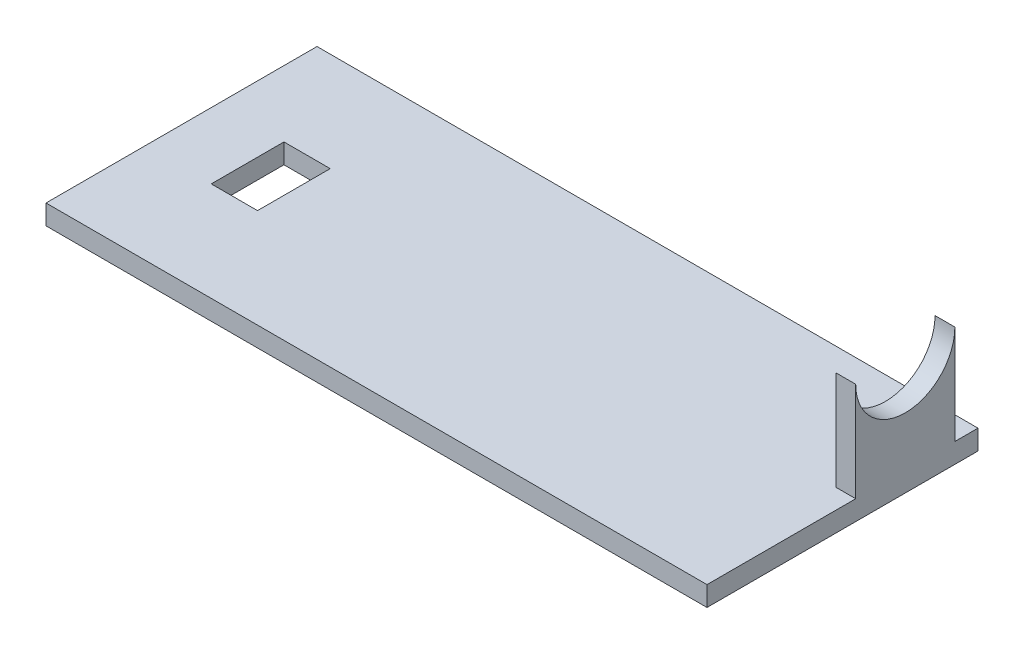
ISO-10303-21;
HEADER;
FILE_DESCRIPTION(('STEP AP214'),'2;1');
FILE_NAME('part.step','',(''),(''),'','','');
FILE_SCHEMA(('AUTOMOTIVE_DESIGN { 1 0 10303 214 1 1 1 1 }'));
ENDSEC;
DATA;
#1=APPLICATION_CONTEXT('core data for automotive mechanical design processes');
#2=APPLICATION_PROTOCOL_DEFINITION('international standard','automotive_design',2000,#1);
#3=PRODUCT_CONTEXT('',#1,'mechanical');
#4=PRODUCT('Part','Part','',(#3));
#5=PRODUCT_RELATED_PRODUCT_CATEGORY('part','',(#4));
#6=PRODUCT_DEFINITION_FORMATION('','',#4);
#7=PRODUCT_DEFINITION_CONTEXT('part definition',#1,'design');
#8=PRODUCT_DEFINITION('design','',#6,#7);
#9=PRODUCT_DEFINITION_SHAPE('','',#8);
#10=(LENGTH_UNIT() NAMED_UNIT(*) SI_UNIT(.MILLI.,.METRE.));
#11=(NAMED_UNIT(*) PLANE_ANGLE_UNIT() SI_UNIT($,.RADIAN.));
#12=(NAMED_UNIT(*) SI_UNIT($,.STERADIAN.) SOLID_ANGLE_UNIT());
#13=UNCERTAINTY_MEASURE_WITH_UNIT(LENGTH_MEASURE(1.E-05),#10,'distance_accuracy_value','');
#14=(GEOMETRIC_REPRESENTATION_CONTEXT(3) GLOBAL_UNCERTAINTY_ASSIGNED_CONTEXT((#13)) GLOBAL_UNIT_ASSIGNED_CONTEXT((#10,
#11,#12)) REPRESENTATION_CONTEXT('',''));
#15=CARTESIAN_POINT('',(0.,0.,0.));
#16=DIRECTION('',(0.,0.,1.));
#17=DIRECTION('',(1.,0.,0.));
#18=AXIS2_PLACEMENT_3D('',#15,#16,#17);
#19=CARTESIAN_POINT('',(-50.,3.,20.5));
#20=DIRECTION('',(1.,0.,0.));
#21=DIRECTION('',(0.,0.,-1.));
#22=AXIS2_PLACEMENT_3D('',#19,#20,#21);
#23=PLANE('',#22);
#24=DIRECTION('',(0.,0.,1.));
#25=VECTOR('',#24,1.);
#26=CARTESIAN_POINT('',(-50.,0.,20.5));
#27=LINE('',#26,#25);
#28=CARTESIAN_POINT('',(-50.,0.,-20.5));
#29=VERTEX_POINT('',#28);
#30=CARTESIAN_POINT('',(-50.,0.,20.5));
#31=VERTEX_POINT('',#30);
#32=EDGE_CURVE('E209',#29,#31,#27,.T.);
#33=ORIENTED_EDGE('',*,*,#32,.T.);
#34=DIRECTION('',(0.,-1.,0.));
#35=VECTOR('',#34,1.);
#36=CARTESIAN_POINT('',(-50.,3.,20.5));
#37=LINE('',#36,#35);
#38=CARTESIAN_POINT('',(-50.,3.,20.5));
#39=VERTEX_POINT('',#38);
#40=EDGE_CURVE('E11',#39,#31,#37,.T.);
#41=ORIENTED_EDGE('',*,*,#40,.F.);
#42=DIRECTION('',(0.,0.,1.));
#43=VECTOR('',#42,1.);
#44=CARTESIAN_POINT('',(-50.,3.,20.5));
#45=LINE('',#44,#43);
#46=CARTESIAN_POINT('',(-50.,3.,-20.5));
#47=VERTEX_POINT('',#46);
#48=EDGE_CURVE('E219',#47,#39,#45,.T.);
#49=ORIENTED_EDGE('',*,*,#48,.F.);
#50=DIRECTION('',(0.,-1.,0.));
#51=VECTOR('',#50,1.);
#52=CARTESIAN_POINT('',(-50.,3.,-20.5));
#53=LINE('',#52,#51);
#54=EDGE_CURVE('E233',#47,#29,#53,.T.);
#55=ORIENTED_EDGE('',*,*,#54,.T.);
#56=EDGE_LOOP('',(#33,#41,#49,#55));
#57=FACE_BOUND('',#56,.T.);
#58=ADVANCED_FACE('F39',(#57),#23,.F.);
#59=CARTESIAN_POINT('',(50.,3.,20.5));
#60=DIRECTION('',(0.,0.,-1.));
#61=DIRECTION('',(-1.,0.,0.));
#62=AXIS2_PLACEMENT_3D('',#59,#60,#61);
#63=PLANE('',#62);
#64=DIRECTION('',(1.,0.,0.));
#65=VECTOR('',#64,1.);
#66=CARTESIAN_POINT('',(50.,0.,20.5));
#67=LINE('',#66,#65);
#68=CARTESIAN_POINT('',(50.,0.,20.5));
#69=VERTEX_POINT('',#68);
#70=EDGE_CURVE('E237',#31,#69,#67,.T.);
#71=ORIENTED_EDGE('',*,*,#70,.T.);
#72=DIRECTION('',(0.,-1.,0.));
#73=VECTOR('',#72,1.);
#74=CARTESIAN_POINT('',(50.,3.,20.5));
#75=LINE('',#74,#73);
#76=CARTESIAN_POINT('',(50.,3.,20.5));
#77=VERTEX_POINT('',#76);
#78=EDGE_CURVE('E47',#77,#69,#75,.T.);
#79=ORIENTED_EDGE('',*,*,#78,.F.);
#80=DIRECTION('',(1.,0.,0.));
#81=VECTOR('',#80,1.);
#82=CARTESIAN_POINT('',(50.,3.,20.5));
#83=LINE('',#82,#81);
#84=EDGE_CURVE('E223',#39,#77,#83,.T.);
#85=ORIENTED_EDGE('',*,*,#84,.F.);
#86=ORIENTED_EDGE('',*,*,#40,.T.);
#87=EDGE_LOOP('',(#71,#79,#85,#86));
#88=FACE_BOUND('',#87,.T.);
#89=ADVANCED_FACE('F287',(#88),#63,.F.);
#90=CARTESIAN_POINT('',(50.,3.,20.5));
#91=DIRECTION('',(-1.,0.,0.));
#92=DIRECTION('',(0.,0.,1.));
#93=AXIS2_PLACEMENT_3D('',#90,#91,#92);
#94=PLANE('',#93);
#95=DIRECTION('',(0.,-1.,0.));
#96=VECTOR('',#95,1.);
#97=CARTESIAN_POINT('',(50.,18.,-17.));
#98=LINE('',#97,#96);
#99=CARTESIAN_POINT('',(50.,18.,-17.));
#100=VERTEX_POINT('',#99);
#101=CARTESIAN_POINT('',(50.,3.,-17.));
#102=VERTEX_POINT('',#101);
#103=EDGE_CURVE('E141',#100,#102,#98,.T.);
#104=ORIENTED_EDGE('',*,*,#103,.F.);
#105=CARTESIAN_POINT('',(50.,18.,-9.50000000000002));
#106=DIRECTION('',(1.,0.,0.));
#107=DIRECTION('',(0.,0.,-1.));
#108=AXIS2_PLACEMENT_3D('',#105,#106,#107);
#109=CIRCLE('',#108,7.5);
#110=CARTESIAN_POINT('',(50.,18.,-2.00000000000002));
#111=VERTEX_POINT('',#110);
#112=EDGE_CURVE('E125',#111,#100,#109,.T.);
#113=ORIENTED_EDGE('',*,*,#112,.F.);
#114=DIRECTION('',(0.,-1.,0.));
#115=VECTOR('',#114,1.);
#116=CARTESIAN_POINT('',(50.,18.,-2.00000000000002));
#117=LINE('',#116,#115);
#118=CARTESIAN_POINT('',(50.,3.,-2.00000000000002));
#119=VERTEX_POINT('',#118);
#120=EDGE_CURVE('E153',#111,#119,#117,.T.);
#121=ORIENTED_EDGE('',*,*,#120,.T.);
#122=DIRECTION('',(0.,0.,-1.));
#123=VECTOR('',#122,1.);
#124=CARTESIAN_POINT('',(50.,3.,20.5));
#125=LINE('',#124,#123);
#126=EDGE_CURVE('E227',#77,#119,#125,.T.);
#127=ORIENTED_EDGE('',*,*,#126,.F.);
#128=ORIENTED_EDGE('',*,*,#78,.T.);
#129=DIRECTION('',(0.,0.,-1.));
#130=VECTOR('',#129,1.);
#131=CARTESIAN_POINT('',(50.,0.,20.5));
#132=LINE('',#131,#130);
#133=CARTESIAN_POINT('',(50.,0.,-20.5));
#134=VERTEX_POINT('',#133);
#135=EDGE_CURVE('E240',#69,#134,#132,.T.);
#136=ORIENTED_EDGE('',*,*,#135,.T.);
#137=DIRECTION('',(0.,-1.,0.));
#138=VECTOR('',#137,1.);
#139=CARTESIAN_POINT('',(50.,3.,-20.5));
#140=LINE('',#139,#138);
#141=CARTESIAN_POINT('',(50.,3.,-20.5));
#142=VERTEX_POINT('',#141);
#143=EDGE_CURVE('E248',#142,#134,#140,.T.);
#144=ORIENTED_EDGE('',*,*,#143,.F.);
#145=EDGE_CURVE('E144',#102,#142,#125,.T.);
#146=ORIENTED_EDGE('',*,*,#145,.F.);
#147=EDGE_LOOP('',(#104,#113,#121,#127,#128,#136,#144,#146));
#148=FACE_BOUND('',#147,.T.);
#149=ADVANCED_FACE('F142',(#148),#94,.F.);
#150=CARTESIAN_POINT('',(50.,3.,-20.5));
#151=DIRECTION('',(0.,0.,1.));
#152=DIRECTION('',(1.,0.,0.));
#153=AXIS2_PLACEMENT_3D('',#150,#151,#152);
#154=PLANE('',#153);
#155=DIRECTION('',(-1.,0.,0.));
#156=VECTOR('',#155,1.);
#157=CARTESIAN_POINT('',(50.,0.,-20.5));
#158=LINE('',#157,#156);
#159=EDGE_CURVE('E224',#134,#29,#158,.T.);
#160=ORIENTED_EDGE('',*,*,#159,.T.);
#161=ORIENTED_EDGE('',*,*,#54,.F.);
#162=DIRECTION('',(-1.,0.,0.));
#163=VECTOR('',#162,1.);
#164=CARTESIAN_POINT('',(50.,3.,-20.5));
#165=LINE('',#164,#163);
#166=EDGE_CURVE('E230',#142,#47,#165,.T.);
#167=ORIENTED_EDGE('',*,*,#166,.F.);
#168=ORIENTED_EDGE('',*,*,#143,.T.);
#169=EDGE_LOOP('',(#160,#161,#167,#168));
#170=FACE_BOUND('',#169,.T.);
#171=ADVANCED_FACE('F263',(#170),#154,.F.);
#172=CARTESIAN_POINT('',(0.,3.,0.));
#173=DIRECTION('',(0.,1.,0.));
#174=DIRECTION('',(0.,0.,1.));
#175=AXIS2_PLACEMENT_3D('',#172,#173,#174);
#176=PLANE('',#175);
#177=DIRECTION('',(-1.,0.,0.));
#178=VECTOR('',#177,1.);
#179=CARTESIAN_POINT('',(0.,3.,-17.));
#180=LINE('',#179,#178);
#181=CARTESIAN_POINT('',(47.,3.,-17.));
#182=VERTEX_POINT('',#181);
#183=EDGE_CURVE('E171',#102,#182,#180,.T.);
#184=ORIENTED_EDGE('',*,*,#183,.F.);
#185=ORIENTED_EDGE('',*,*,#145,.T.);
#186=ORIENTED_EDGE('',*,*,#166,.T.);
#187=ORIENTED_EDGE('',*,*,#48,.T.);
#188=ORIENTED_EDGE('',*,*,#84,.T.);
#189=ORIENTED_EDGE('',*,*,#126,.T.);
#190=DIRECTION('',(1.,0.,0.));
#191=VECTOR('',#190,1.);
#192=CARTESIAN_POINT('',(0.,3.,-2.00000000000002));
#193=LINE('',#192,#191);
#194=CARTESIAN_POINT('',(47.,3.,-2.00000000000002));
#195=VERTEX_POINT('',#194);
#196=EDGE_CURVE('E59',#195,#119,#193,.T.);
#197=ORIENTED_EDGE('',*,*,#196,.F.);
#198=DIRECTION('',(0.,0.,1.));
#199=VECTOR('',#198,1.);
#200=CARTESIAN_POINT('',(47.,3.,0.));
#201=LINE('',#200,#199);
#202=EDGE_CURVE('E54',#182,#195,#201,.T.);
#203=ORIENTED_EDGE('',*,*,#202,.F.);
#204=EDGE_LOOP('',(#184,#185,#186,#187,#188,#189,#197,#203));
#205=FACE_BOUND('',#204,.T.);
#206=DIRECTION('',(0.,0.,1.));
#207=VECTOR('',#206,1.);
#208=CARTESIAN_POINT('',(-40.,3.,-5.49999999999999));
#209=LINE('',#208,#207);
#210=CARTESIAN_POINT('',(-40.,3.,-5.49999999999999));
#211=VERTEX_POINT('',#210);
#212=CARTESIAN_POINT('',(-40.,3.,5.50000000000001));
#213=VERTEX_POINT('',#212);
#214=EDGE_CURVE('E174',#211,#213,#209,.T.);
#215=ORIENTED_EDGE('',*,*,#214,.F.);
#216=DIRECTION('',(-1.,0.,0.));
#217=VECTOR('',#216,1.);
#218=CARTESIAN_POINT('',(-40.,3.,-5.49999999999999));
#219=LINE('',#218,#217);
#220=CARTESIAN_POINT('',(-33.,3.,-5.49999999999999));
#221=VERTEX_POINT('',#220);
#222=EDGE_CURVE('E180',#221,#211,#219,.T.);
#223=ORIENTED_EDGE('',*,*,#222,.F.);
#224=DIRECTION('',(0.,0.,-1.));
#225=VECTOR('',#224,1.);
#226=CARTESIAN_POINT('',(-33.,3.,-5.49999999999999));
#227=LINE('',#226,#225);
#228=CARTESIAN_POINT('',(-33.,3.,5.5));
#229=VERTEX_POINT('',#228);
#230=EDGE_CURVE('E199',#229,#221,#227,.T.);
#231=ORIENTED_EDGE('',*,*,#230,.F.);
#232=DIRECTION('',(1.,0.,0.));
#233=VECTOR('',#232,1.);
#234=CARTESIAN_POINT('',(-40.,3.,5.50000000000001));
#235=LINE('',#234,#233);
#236=EDGE_CURVE('E195',#213,#229,#235,.T.);
#237=ORIENTED_EDGE('',*,*,#236,.F.);
#238=EDGE_LOOP('',(#215,#223,#231,#237));
#239=FACE_BOUND('',#238,.T.);
#240=ADVANCED_FACE('F268',(#205,#239),#176,.T.);
#241=CARTESIAN_POINT('',(0.,0.,0.));
#242=DIRECTION('',(0.,1.,0.));
#243=DIRECTION('',(0.,0.,1.));
#244=AXIS2_PLACEMENT_3D('',#241,#242,#243);
#245=PLANE('',#244);
#246=DIRECTION('',(-1.,0.,0.));
#247=VECTOR('',#246,1.);
#248=CARTESIAN_POINT('',(-40.,0.,-5.49999999999999));
#249=LINE('',#248,#247);
#250=CARTESIAN_POINT('',(-33.,0.,-5.49999999999999));
#251=VERTEX_POINT('',#250);
#252=CARTESIAN_POINT('',(-40.,0.,-5.49999999999999));
#253=VERTEX_POINT('',#252);
#254=EDGE_CURVE('E188',#251,#253,#249,.T.);
#255=ORIENTED_EDGE('',*,*,#254,.T.);
#256=DIRECTION('',(0.,0.,1.));
#257=VECTOR('',#256,1.);
#258=CARTESIAN_POINT('',(-40.,0.,-5.49999999999999));
#259=LINE('',#258,#257);
#260=CARTESIAN_POINT('',(-40.,0.,5.50000000000001));
#261=VERTEX_POINT('',#260);
#262=EDGE_CURVE('E175',#253,#261,#259,.T.);
#263=ORIENTED_EDGE('',*,*,#262,.T.);
#264=DIRECTION('',(1.,0.,0.));
#265=VECTOR('',#264,1.);
#266=CARTESIAN_POINT('',(-40.,0.,5.50000000000001));
#267=LINE('',#266,#265);
#268=CARTESIAN_POINT('',(-33.,0.,5.5));
#269=VERTEX_POINT('',#268);
#270=EDGE_CURVE('E179',#261,#269,#267,.T.);
#271=ORIENTED_EDGE('',*,*,#270,.T.);
#272=DIRECTION('',(0.,0.,-1.));
#273=VECTOR('',#272,1.);
#274=CARTESIAN_POINT('',(-33.,0.,-5.49999999999999));
#275=LINE('',#274,#273);
#276=EDGE_CURVE('E184',#269,#251,#275,.T.);
#277=ORIENTED_EDGE('',*,*,#276,.T.);
#278=EDGE_LOOP('',(#255,#263,#271,#277));
#279=FACE_BOUND('',#278,.T.);
#280=ORIENTED_EDGE('',*,*,#159,.F.);
#281=ORIENTED_EDGE('',*,*,#135,.F.);
#282=ORIENTED_EDGE('',*,*,#70,.F.);
#283=ORIENTED_EDGE('',*,*,#32,.F.);
#284=EDGE_LOOP('',(#280,#281,#282,#283));
#285=FACE_BOUND('',#284,.T.);
#286=ADVANCED_FACE('F259',(#279,#285),#245,.F.);
#287=CARTESIAN_POINT('',(-40.,0.,-5.49999999999999));
#288=DIRECTION('',(-1.,0.,0.));
#289=DIRECTION('',(0.,0.,1.));
#290=AXIS2_PLACEMENT_3D('',#287,#288,#289);
#291=PLANE('',#290);
#292=ORIENTED_EDGE('',*,*,#214,.T.);
#293=DIRECTION('',(0.,1.,0.));
#294=VECTOR('',#293,1.);
#295=CARTESIAN_POINT('',(-40.,0.,5.50000000000001));
#296=LINE('',#295,#294);
#297=EDGE_CURVE('E192',#261,#213,#296,.T.);
#298=ORIENTED_EDGE('',*,*,#297,.F.);
#299=ORIENTED_EDGE('',*,*,#262,.F.);
#300=DIRECTION('',(0.,1.,0.));
#301=VECTOR('',#300,1.);
#302=CARTESIAN_POINT('',(-40.,0.,-5.49999999999999));
#303=LINE('',#302,#301);
#304=EDGE_CURVE('E206',#253,#211,#303,.T.);
#305=ORIENTED_EDGE('',*,*,#304,.T.);
#306=EDGE_LOOP('',(#292,#298,#299,#305));
#307=FACE_BOUND('',#306,.T.);
#308=ADVANCED_FACE('F300',(#307),#291,.F.);
#309=CARTESIAN_POINT('',(-40.,0.,-5.49999999999999));
#310=DIRECTION('',(0.,0.,-1.));
#311=DIRECTION('',(-1.,0.,0.));
#312=AXIS2_PLACEMENT_3D('',#309,#310,#311);
#313=PLANE('',#312);
#314=ORIENTED_EDGE('',*,*,#222,.T.);
#315=ORIENTED_EDGE('',*,*,#304,.F.);
#316=ORIENTED_EDGE('',*,*,#254,.F.);
#317=DIRECTION('',(0.,1.,0.));
#318=VECTOR('',#317,1.);
#319=CARTESIAN_POINT('',(-33.,0.,-5.49999999999999));
#320=LINE('',#319,#318);
#321=EDGE_CURVE('E210',#251,#221,#320,.T.);
#322=ORIENTED_EDGE('',*,*,#321,.T.);
#323=EDGE_LOOP('',(#314,#315,#316,#322));
#324=FACE_BOUND('',#323,.T.);
#325=ADVANCED_FACE('F306',(#324),#313,.F.);
#326=CARTESIAN_POINT('',(-33.,0.,-5.49999999999999));
#327=DIRECTION('',(1.,0.,0.));
#328=DIRECTION('',(0.,0.,-1.));
#329=AXIS2_PLACEMENT_3D('',#326,#327,#328);
#330=PLANE('',#329);
#331=ORIENTED_EDGE('',*,*,#230,.T.);
#332=ORIENTED_EDGE('',*,*,#321,.F.);
#333=ORIENTED_EDGE('',*,*,#276,.F.);
#334=DIRECTION('',(0.,1.,0.));
#335=VECTOR('',#334,1.);
#336=CARTESIAN_POINT('',(-33.,0.,5.5));
#337=LINE('',#336,#335);
#338=EDGE_CURVE('E213',#269,#229,#337,.T.);
#339=ORIENTED_EDGE('',*,*,#338,.T.);
#340=EDGE_LOOP('',(#331,#332,#333,#339));
#341=FACE_BOUND('',#340,.T.);
#342=ADVANCED_FACE('F311',(#341),#330,.F.);
#343=CARTESIAN_POINT('',(-40.,0.,5.50000000000001));
#344=DIRECTION('',(0.,0.,1.));
#345=DIRECTION('',(1.,0.,0.));
#346=AXIS2_PLACEMENT_3D('',#343,#344,#345);
#347=PLANE('',#346);
#348=ORIENTED_EDGE('',*,*,#236,.T.);
#349=ORIENTED_EDGE('',*,*,#338,.F.);
#350=ORIENTED_EDGE('',*,*,#270,.F.);
#351=ORIENTED_EDGE('',*,*,#297,.T.);
#352=EDGE_LOOP('',(#348,#349,#350,#351));
#353=FACE_BOUND('',#352,.T.);
#354=ADVANCED_FACE('F308',(#353),#347,.F.);
#355=CARTESIAN_POINT('',(50.,18.,-17.));
#356=DIRECTION('',(0.,0.,-1.));
#357=DIRECTION('',(-1.,0.,0.));
#358=AXIS2_PLACEMENT_3D('',#355,#356,#357);
#359=PLANE('',#358);
#360=ORIENTED_EDGE('',*,*,#103,.T.);
#361=ORIENTED_EDGE('',*,*,#183,.T.);
#362=DIRECTION('',(0.,-1.,0.));
#363=VECTOR('',#362,1.);
#364=CARTESIAN_POINT('',(47.,18.,-17.));
#365=LINE('',#364,#363);
#366=CARTESIAN_POINT('',(47.,18.,-17.));
#367=VERTEX_POINT('',#366);
#368=EDGE_CURVE('E147',#367,#182,#365,.T.);
#369=ORIENTED_EDGE('',*,*,#368,.F.);
#370=DIRECTION('',(1.,0.,0.));
#371=VECTOR('',#370,1.);
#372=CARTESIAN_POINT('',(50.,18.,-17.));
#373=LINE('',#372,#371);
#374=EDGE_CURVE('E129',#367,#100,#373,.T.);
#375=ORIENTED_EDGE('',*,*,#374,.T.);
#376=EDGE_LOOP('',(#360,#361,#369,#375));
#377=FACE_BOUND('',#376,.T.);
#378=ADVANCED_FACE('F150',(#377),#359,.T.);
#379=CARTESIAN_POINT('',(47.,18.,-17.));
#380=DIRECTION('',(-1.,0.,0.));
#381=DIRECTION('',(0.,0.,1.));
#382=AXIS2_PLACEMENT_3D('',#379,#380,#381);
#383=PLANE('',#382);
#384=CARTESIAN_POINT('',(47.,18.,-9.50000000000002));
#385=DIRECTION('',(-1.,0.,0.));
#386=DIRECTION('',(0.,0.,1.));
#387=AXIS2_PLACEMENT_3D('',#384,#385,#386);
#388=CIRCLE('',#387,7.5);
#389=CARTESIAN_POINT('',(47.,18.,-2.00000000000002));
#390=VERTEX_POINT('',#389);
#391=EDGE_CURVE('E137',#367,#390,#388,.T.);
#392=ORIENTED_EDGE('',*,*,#391,.F.);
#393=ORIENTED_EDGE('',*,*,#368,.T.);
#394=ORIENTED_EDGE('',*,*,#202,.T.);
#395=DIRECTION('',(0.,-1.,0.));
#396=VECTOR('',#395,1.);
#397=CARTESIAN_POINT('',(47.,18.,-2.00000000000002));
#398=LINE('',#397,#396);
#399=EDGE_CURVE('E157',#390,#195,#398,.T.);
#400=ORIENTED_EDGE('',*,*,#399,.F.);
#401=EDGE_LOOP('',(#392,#393,#394,#400));
#402=FACE_BOUND('',#401,.T.);
#403=ADVANCED_FACE('F272',(#402),#383,.T.);
#404=CARTESIAN_POINT('',(50.,18.,-2.00000000000002));
#405=DIRECTION('',(0.,0.,1.));
#406=DIRECTION('',(1.,0.,0.));
#407=AXIS2_PLACEMENT_3D('',#404,#405,#406);
#408=PLANE('',#407);
#409=ORIENTED_EDGE('',*,*,#399,.T.);
#410=ORIENTED_EDGE('',*,*,#196,.T.);
#411=ORIENTED_EDGE('',*,*,#120,.F.);
#412=DIRECTION('',(-1.,0.,0.));
#413=VECTOR('',#412,1.);
#414=CARTESIAN_POINT('',(50.,18.,-2.00000000000002));
#415=LINE('',#414,#413);
#416=EDGE_CURVE('E132',#111,#390,#415,.T.);
#417=ORIENTED_EDGE('',*,*,#416,.T.);
#418=EDGE_LOOP('',(#409,#410,#411,#417));
#419=FACE_BOUND('',#418,.T.);
#420=ADVANCED_FACE('F276',(#419),#408,.T.);
#421=CARTESIAN_POINT('',(44.,18.,-9.50000000000002));
#422=DIRECTION('',(1.,0.,0.));
#423=DIRECTION('',(0.,0.,-1.));
#424=AXIS2_PLACEMENT_3D('',#421,#422,#423);
#425=CYLINDRICAL_SURFACE('',#424,7.5);
#426=ORIENTED_EDGE('',*,*,#391,.T.);
#427=ORIENTED_EDGE('',*,*,#416,.F.);
#428=ORIENTED_EDGE('',*,*,#112,.T.);
#429=ORIENTED_EDGE('',*,*,#374,.F.);
#430=EDGE_LOOP('',(#426,#427,#428,#429));
#431=FACE_BOUND('',#430,.T.);
#432=ADVANCED_FACE('F127',(#431),#425,.F.);
#433=CLOSED_SHELL('',(#58,#89,#149,#171,#240,#286,#308,#325,#342,#354,#378,#403,#420,#432));
#434=MANIFOLD_SOLID_BREP('B2',#433);
#435=ADVANCED_BREP_SHAPE_REPRESENTATION('',(#18,#434),#14);
#436=SHAPE_DEFINITION_REPRESENTATION(#9,#435);
ENDSEC;
END-ISO-10303-21;
